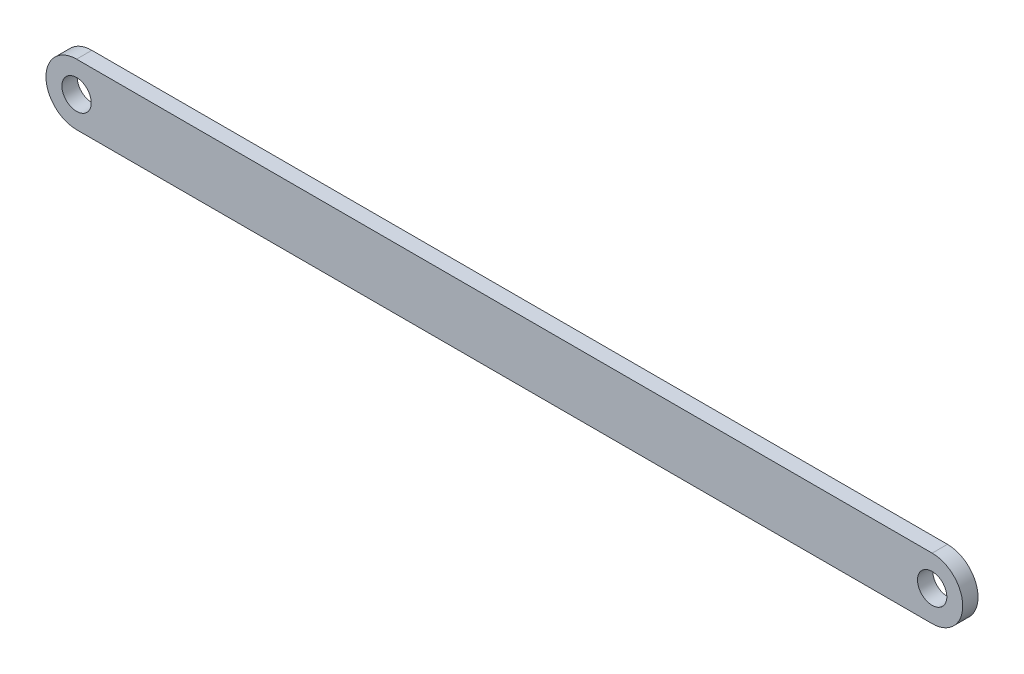
ISO-10303-21;
HEADER;
FILE_DESCRIPTION(('STEP AP214'),'2;1');
FILE_NAME('part.step','',(''),(''),'','','');
FILE_SCHEMA(('AUTOMOTIVE_DESIGN { 1 0 10303 214 1 1 1 1 }'));
ENDSEC;
DATA;
#1=APPLICATION_CONTEXT('core data for automotive mechanical design processes');
#2=APPLICATION_PROTOCOL_DEFINITION('international standard','automotive_design',2000,#1);
#3=PRODUCT_CONTEXT('',#1,'mechanical');
#4=PRODUCT('Part','Part','',(#3));
#5=PRODUCT_RELATED_PRODUCT_CATEGORY('part','',(#4));
#6=PRODUCT_DEFINITION_FORMATION('','',#4);
#7=PRODUCT_DEFINITION_CONTEXT('part definition',#1,'design');
#8=PRODUCT_DEFINITION('design','',#6,#7);
#9=PRODUCT_DEFINITION_SHAPE('','',#8);
#10=(LENGTH_UNIT() NAMED_UNIT(*) SI_UNIT(.MILLI.,.METRE.));
#11=(NAMED_UNIT(*) PLANE_ANGLE_UNIT() SI_UNIT($,.RADIAN.));
#12=(NAMED_UNIT(*) SI_UNIT($,.STERADIAN.) SOLID_ANGLE_UNIT());
#13=UNCERTAINTY_MEASURE_WITH_UNIT(LENGTH_MEASURE(1.E-05),#10,'distance_accuracy_value','');
#14=(GEOMETRIC_REPRESENTATION_CONTEXT(3) GLOBAL_UNCERTAINTY_ASSIGNED_CONTEXT((#13)) GLOBAL_UNIT_ASSIGNED_CONTEXT((#10,
#11,#12)) REPRESENTATION_CONTEXT('',''));
#15=CARTESIAN_POINT('',(0.,0.,0.));
#16=DIRECTION('',(0.,0.,1.));
#17=DIRECTION('',(1.,0.,0.));
#18=AXIS2_PLACEMENT_3D('',#15,#16,#17);
#19=CARTESIAN_POINT('',(88.9,0.,3.175));
#20=DIRECTION('',(0.,0.,-1.));
#21=DIRECTION('',(-1.,0.,0.));
#22=AXIS2_PLACEMENT_3D('',#19,#20,#21);
#23=PLANE('',#22);
#24=CARTESIAN_POINT('',(88.9,0.,3.175));
#25=DIRECTION('',(0.,0.,1.));
#26=DIRECTION('',(-1.,0.,0.));
#27=AXIS2_PLACEMENT_3D('',#24,#25,#26);
#28=CIRCLE('',#27,6.35);
#29=CARTESIAN_POINT('',(88.9,-6.35,3.175));
#30=VERTEX_POINT('',#29);
#31=CARTESIAN_POINT('',(88.9,6.35,3.175));
#32=VERTEX_POINT('',#31);
#33=EDGE_CURVE('E92',#30,#32,#28,.T.);
#34=ORIENTED_EDGE('',*,*,#33,.T.);
#35=DIRECTION('',(-1.,0.,0.));
#36=VECTOR('',#35,1.);
#37=CARTESIAN_POINT('',(-88.9,6.35,3.175));
#38=LINE('',#37,#36);
#39=CARTESIAN_POINT('',(-88.9,6.35,3.175));
#40=VERTEX_POINT('',#39);
#41=EDGE_CURVE('E87',#32,#40,#38,.T.);
#42=ORIENTED_EDGE('',*,*,#41,.T.);
#43=CARTESIAN_POINT('',(-88.9,0.,3.175));
#44=DIRECTION('',(0.,0.,1.));
#45=DIRECTION('',(1.,0.,0.));
#46=AXIS2_PLACEMENT_3D('',#43,#44,#45);
#47=CIRCLE('',#46,6.35);
#48=CARTESIAN_POINT('',(-88.9,-6.35,3.175));
#49=VERTEX_POINT('',#48);
#50=EDGE_CURVE('E90',#40,#49,#47,.T.);
#51=ORIENTED_EDGE('',*,*,#50,.T.);
#52=DIRECTION('',(1.,0.,0.));
#53=VECTOR('',#52,1.);
#54=CARTESIAN_POINT('',(-88.9,-6.35,3.175));
#55=LINE('',#54,#53);
#56=EDGE_CURVE('E57',#49,#30,#55,.T.);
#57=ORIENTED_EDGE('',*,*,#56,.T.);
#58=EDGE_LOOP('',(#34,#42,#51,#57));
#59=FACE_BOUND('',#58,.T.);
#60=CARTESIAN_POINT('',(-88.9,0.,3.175));
#61=DIRECTION('',(0.,0.,1.));
#62=DIRECTION('',(1.,0.,0.));
#63=AXIS2_PLACEMENT_3D('',#60,#61,#62);
#64=CIRCLE('',#63,3.048);
#65=CARTESIAN_POINT('',(-85.852,0.,3.175));
#66=VERTEX_POINT('',#65);
#67=EDGE_CURVE('E112',#66,#66,#64,.T.);
#68=ORIENTED_EDGE('',*,*,#67,.F.);
#69=EDGE_LOOP('',(#68));
#70=FACE_BOUND('',#69,.T.);
#71=CARTESIAN_POINT('',(88.9,0.,3.175));
#72=DIRECTION('',(0.,0.,1.));
#73=DIRECTION('',(1.,0.,0.));
#74=AXIS2_PLACEMENT_3D('',#71,#72,#73);
#75=CIRCLE('',#74,3.048);
#76=CARTESIAN_POINT('',(91.948,0.,3.175));
#77=VERTEX_POINT('',#76);
#78=EDGE_CURVE('E134',#77,#77,#75,.T.);
#79=ORIENTED_EDGE('',*,*,#78,.F.);
#80=EDGE_LOOP('',(#79));
#81=FACE_BOUND('',#80,.T.);
#82=ADVANCED_FACE('F39',(#59,#70,#81),#23,.F.);
#83=CARTESIAN_POINT('',(88.9,0.,0.));
#84=DIRECTION('',(0.,0.,-1.));
#85=DIRECTION('',(-1.,0.,0.));
#86=AXIS2_PLACEMENT_3D('',#83,#84,#85);
#87=PLANE('',#86);
#88=CARTESIAN_POINT('',(-88.9,0.,0.));
#89=DIRECTION('',(0.,0.,1.));
#90=DIRECTION('',(1.,0.,0.));
#91=AXIS2_PLACEMENT_3D('',#88,#89,#90);
#92=CIRCLE('',#91,3.048);
#93=CARTESIAN_POINT('',(-85.852,0.,0.));
#94=VERTEX_POINT('',#93);
#95=EDGE_CURVE('E130',#94,#94,#92,.T.);
#96=ORIENTED_EDGE('',*,*,#95,.T.);
#97=EDGE_LOOP('',(#96));
#98=FACE_BOUND('',#97,.T.);
#99=CARTESIAN_POINT('',(88.9,0.,0.));
#100=DIRECTION('',(0.,0.,1.));
#101=DIRECTION('',(-1.,0.,0.));
#102=AXIS2_PLACEMENT_3D('',#99,#100,#101);
#103=CIRCLE('',#102,6.35);
#104=CARTESIAN_POINT('',(88.9,-6.35,0.));
#105=VERTEX_POINT('',#104);
#106=CARTESIAN_POINT('',(88.9,6.35,0.));
#107=VERTEX_POINT('',#106);
#108=EDGE_CURVE('E108',#105,#107,#103,.T.);
#109=ORIENTED_EDGE('',*,*,#108,.F.);
#110=DIRECTION('',(1.,0.,0.));
#111=VECTOR('',#110,1.);
#112=CARTESIAN_POINT('',(-88.9,-6.35,0.));
#113=LINE('',#112,#111);
#114=CARTESIAN_POINT('',(-88.9,-6.35,0.));
#115=VERTEX_POINT('',#114);
#116=EDGE_CURVE('E80',#115,#105,#113,.T.);
#117=ORIENTED_EDGE('',*,*,#116,.F.);
#118=CARTESIAN_POINT('',(-88.9,0.,0.));
#119=DIRECTION('',(0.,0.,1.));
#120=DIRECTION('',(1.,0.,0.));
#121=AXIS2_PLACEMENT_3D('',#118,#119,#120);
#122=CIRCLE('',#121,6.35);
#123=CARTESIAN_POINT('',(-88.9,6.35,0.));
#124=VERTEX_POINT('',#123);
#125=EDGE_CURVE('E74',#124,#115,#122,.T.);
#126=ORIENTED_EDGE('',*,*,#125,.F.);
#127=DIRECTION('',(-1.,0.,0.));
#128=VECTOR('',#127,1.);
#129=CARTESIAN_POINT('',(-88.9,6.35,0.));
#130=LINE('',#129,#128);
#131=EDGE_CURVE('E97',#107,#124,#130,.T.);
#132=ORIENTED_EDGE('',*,*,#131,.F.);
#133=EDGE_LOOP('',(#109,#117,#126,#132));
#134=FACE_BOUND('',#133,.T.);
#135=CARTESIAN_POINT('',(88.9,0.,0.));
#136=DIRECTION('',(0.,0.,1.));
#137=DIRECTION('',(1.,0.,0.));
#138=AXIS2_PLACEMENT_3D('',#135,#136,#137);
#139=CIRCLE('',#138,3.048);
#140=CARTESIAN_POINT('',(91.948,0.,0.));
#141=VERTEX_POINT('',#140);
#142=EDGE_CURVE('E138',#141,#141,#139,.T.);
#143=ORIENTED_EDGE('',*,*,#142,.T.);
#144=EDGE_LOOP('',(#143));
#145=FACE_BOUND('',#144,.T.);
#146=ADVANCED_FACE('F125',(#98,#134,#145),#87,.T.);
#147=CARTESIAN_POINT('',(88.9,0.,3.175));
#148=DIRECTION('',(0.,0.,-1.));
#149=DIRECTION('',(-1.,0.,0.));
#150=AXIS2_PLACEMENT_3D('',#147,#148,#149);
#151=CYLINDRICAL_SURFACE('',#150,6.35);
#152=ORIENTED_EDGE('',*,*,#108,.T.);
#153=DIRECTION('',(0.,0.,-1.));
#154=VECTOR('',#153,1.);
#155=CARTESIAN_POINT('',(88.9,6.35,3.175));
#156=LINE('',#155,#154);
#157=EDGE_CURVE('E11',#32,#107,#156,.T.);
#158=ORIENTED_EDGE('',*,*,#157,.F.);
#159=ORIENTED_EDGE('',*,*,#33,.F.);
#160=DIRECTION('',(0.,0.,-1.));
#161=VECTOR('',#160,1.);
#162=CARTESIAN_POINT('',(88.9,-6.35,3.175));
#163=LINE('',#162,#161);
#164=EDGE_CURVE('E104',#30,#105,#163,.T.);
#165=ORIENTED_EDGE('',*,*,#164,.T.);
#166=EDGE_LOOP('',(#152,#158,#159,#165));
#167=FACE_BOUND('',#166,.T.);
#168=ADVANCED_FACE('F41',(#167),#151,.T.);
#169=CARTESIAN_POINT('',(-88.9,6.35,3.175));
#170=DIRECTION('',(0.,-1.,0.));
#171=DIRECTION('',(0.,0.,-1.));
#172=AXIS2_PLACEMENT_3D('',#169,#170,#171);
#173=PLANE('',#172);
#174=ORIENTED_EDGE('',*,*,#131,.T.);
#175=DIRECTION('',(0.,0.,-1.));
#176=VECTOR('',#175,1.);
#177=CARTESIAN_POINT('',(-88.9,6.35,3.175));
#178=LINE('',#177,#176);
#179=EDGE_CURVE('E49',#40,#124,#178,.T.);
#180=ORIENTED_EDGE('',*,*,#179,.F.);
#181=ORIENTED_EDGE('',*,*,#41,.F.);
#182=ORIENTED_EDGE('',*,*,#157,.T.);
#183=EDGE_LOOP('',(#174,#180,#181,#182));
#184=FACE_BOUND('',#183,.T.);
#185=ADVANCED_FACE('F96',(#184),#173,.F.);
#186=CARTESIAN_POINT('',(-88.9,0.,3.175));
#187=DIRECTION('',(0.,0.,-1.));
#188=DIRECTION('',(-1.,0.,0.));
#189=AXIS2_PLACEMENT_3D('',#186,#187,#188);
#190=CYLINDRICAL_SURFACE('',#189,6.35);
#191=ORIENTED_EDGE('',*,*,#125,.T.);
#192=DIRECTION('',(0.,0.,-1.));
#193=VECTOR('',#192,1.);
#194=CARTESIAN_POINT('',(-88.9,-6.35,3.175));
#195=LINE('',#194,#193);
#196=EDGE_CURVE('E99',#49,#115,#195,.T.);
#197=ORIENTED_EDGE('',*,*,#196,.F.);
#198=ORIENTED_EDGE('',*,*,#50,.F.);
#199=ORIENTED_EDGE('',*,*,#179,.T.);
#200=EDGE_LOOP('',(#191,#197,#198,#199));
#201=FACE_BOUND('',#200,.T.);
#202=ADVANCED_FACE('F100',(#201),#190,.T.);
#203=CARTESIAN_POINT('',(-88.9,-6.35,3.175));
#204=DIRECTION('',(0.,1.,0.));
#205=DIRECTION('',(0.,0.,1.));
#206=AXIS2_PLACEMENT_3D('',#203,#204,#205);
#207=PLANE('',#206);
#208=ORIENTED_EDGE('',*,*,#116,.T.);
#209=ORIENTED_EDGE('',*,*,#164,.F.);
#210=ORIENTED_EDGE('',*,*,#56,.F.);
#211=ORIENTED_EDGE('',*,*,#196,.T.);
#212=EDGE_LOOP('',(#208,#209,#210,#211));
#213=FACE_BOUND('',#212,.T.);
#214=ADVANCED_FACE('F122',(#213),#207,.F.);
#215=CARTESIAN_POINT('',(-88.9,0.,3.175));
#216=DIRECTION('',(0.,0.,-1.));
#217=DIRECTION('',(-1.,0.,0.));
#218=AXIS2_PLACEMENT_3D('',#215,#216,#217);
#219=CYLINDRICAL_SURFACE('',#218,3.048);
#220=ORIENTED_EDGE('',*,*,#67,.T.);
#221=EDGE_LOOP('',(#220));
#222=FACE_BOUND('',#221,.T.);
#223=ORIENTED_EDGE('',*,*,#95,.F.);
#224=EDGE_LOOP('',(#223));
#225=FACE_BOUND('',#224,.T.);
#226=ADVANCED_FACE('F157',(#222,#225),#219,.F.);
#227=CARTESIAN_POINT('',(88.9,0.,3.175));
#228=DIRECTION('',(0.,0.,-1.));
#229=DIRECTION('',(-1.,0.,0.));
#230=AXIS2_PLACEMENT_3D('',#227,#228,#229);
#231=CYLINDRICAL_SURFACE('',#230,3.048);
#232=ORIENTED_EDGE('',*,*,#78,.T.);
#233=EDGE_LOOP('',(#232));
#234=FACE_BOUND('',#233,.T.);
#235=ORIENTED_EDGE('',*,*,#142,.F.);
#236=EDGE_LOOP('',(#235));
#237=FACE_BOUND('',#236,.T.);
#238=ADVANCED_FACE('F146',(#234,#237),#231,.F.);
#239=CLOSED_SHELL('',(#82,#146,#168,#185,#202,#214,#226,#238));
#240=MANIFOLD_SOLID_BREP('B2',#239);
#241=ADVANCED_BREP_SHAPE_REPRESENTATION('',(#18,#240),#14);
#242=SHAPE_DEFINITION_REPRESENTATION(#9,#241);
ENDSEC;
END-ISO-10303-21;
